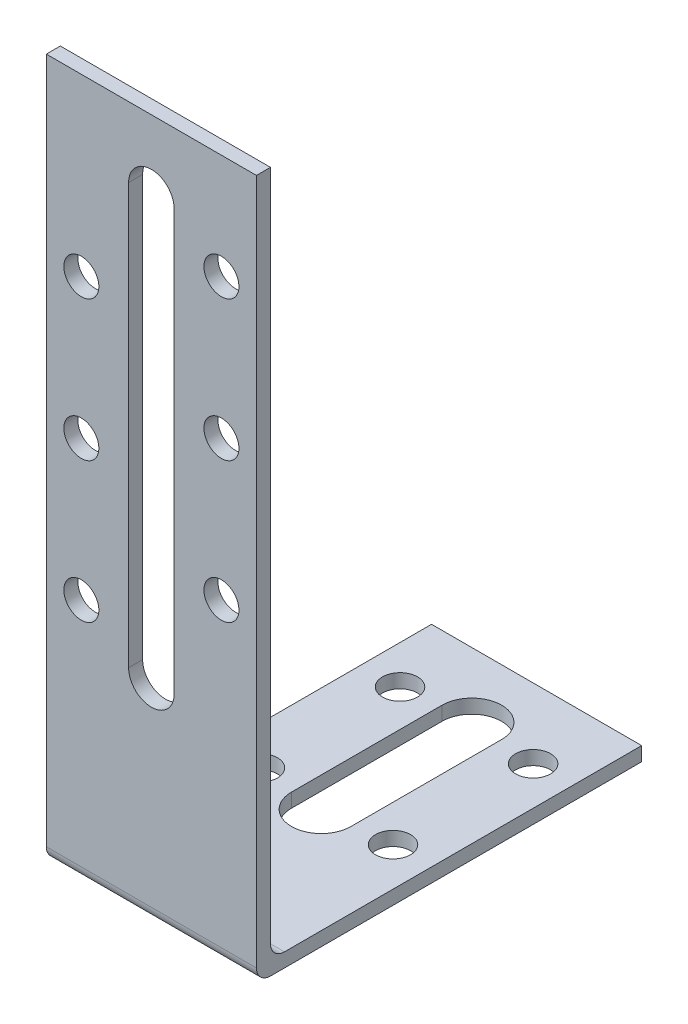
ISO-10303-21;
HEADER;
FILE_DESCRIPTION(('STEP AP214'),'2;1');
FILE_NAME('part.step','',(''),(''),'','','');
FILE_SCHEMA(('AUTOMOTIVE_DESIGN { 1 0 10303 214 1 1 1 1 }'));
ENDSEC;
DATA;
#1=APPLICATION_CONTEXT('core data for automotive mechanical design processes');
#2=APPLICATION_PROTOCOL_DEFINITION('international standard','automotive_design',2000,#1);
#3=PRODUCT_CONTEXT('',#1,'mechanical');
#4=PRODUCT('Part','Part','',(#3));
#5=PRODUCT_RELATED_PRODUCT_CATEGORY('part','',(#4));
#6=PRODUCT_DEFINITION_FORMATION('','',#4);
#7=PRODUCT_DEFINITION_CONTEXT('part definition',#1,'design');
#8=PRODUCT_DEFINITION('design','',#6,#7);
#9=PRODUCT_DEFINITION_SHAPE('','',#8);
#10=(LENGTH_UNIT() NAMED_UNIT(*) SI_UNIT(.MILLI.,.METRE.));
#11=(NAMED_UNIT(*) PLANE_ANGLE_UNIT() SI_UNIT($,.RADIAN.));
#12=(NAMED_UNIT(*) SI_UNIT($,.STERADIAN.) SOLID_ANGLE_UNIT());
#13=UNCERTAINTY_MEASURE_WITH_UNIT(LENGTH_MEASURE(1.E-05),#10,'distance_accuracy_value','');
#14=(GEOMETRIC_REPRESENTATION_CONTEXT(3) GLOBAL_UNCERTAINTY_ASSIGNED_CONTEXT((#13)) GLOBAL_UNIT_ASSIGNED_CONTEXT((#10,
#11,#12)) REPRESENTATION_CONTEXT('',''));
#15=CARTESIAN_POINT('',(0.,0.,0.));
#16=DIRECTION('',(0.,0.,1.));
#17=DIRECTION('',(1.,0.,0.));
#18=AXIS2_PLACEMENT_3D('',#15,#16,#17);
#19=CARTESIAN_POINT('',(15.,0.,-55.));
#20=DIRECTION('',(0.,1.,0.));
#21=DIRECTION('',(0.,0.,1.));
#22=AXIS2_PLACEMENT_3D('',#19,#20,#21);
#23=PLANE('',#22);
#24=CARTESIAN_POINT('',(9.5,0.,-45.));
#25=DIRECTION('',(0.,1.,0.));
#26=DIRECTION('',(0.,0.,1.));
#27=AXIS2_PLACEMENT_3D('',#24,#25,#26);
#28=CIRCLE('',#27,2.5);
#29=CARTESIAN_POINT('',(9.5,0.,-42.5));
#30=VERTEX_POINT('',#29);
#31=EDGE_CURVE('E209',#30,#30,#28,.F.);
#32=ORIENTED_EDGE('',*,*,#31,.F.);
#33=EDGE_LOOP('',(#32));
#34=FACE_BOUND('',#33,.T.);
#35=CARTESIAN_POINT('',(-9.49999999999999,0.,-25.));
#36=DIRECTION('',(0.,1.,0.));
#37=DIRECTION('',(0.,0.,1.));
#38=AXIS2_PLACEMENT_3D('',#35,#36,#37);
#39=CIRCLE('',#38,2.5);
#40=CARTESIAN_POINT('',(-9.49999999999999,0.,-22.5));
#41=VERTEX_POINT('',#40);
#42=EDGE_CURVE('E199',#41,#41,#39,.F.);
#43=ORIENTED_EDGE('',*,*,#42,.F.);
#44=EDGE_LOOP('',(#43));
#45=FACE_BOUND('',#44,.T.);
#46=CARTESIAN_POINT('',(0.,0.,-24.25));
#47=DIRECTION('',(0.,1.,0.));
#48=DIRECTION('',(0.,0.,1.));
#49=AXIS2_PLACEMENT_3D('',#46,#47,#48);
#50=CIRCLE('',#49,4.25);
#51=CARTESIAN_POINT('',(4.25,0.,-24.25));
#52=VERTEX_POINT('',#51);
#53=CARTESIAN_POINT('',(-4.25,0.,-24.25));
#54=VERTEX_POINT('',#53);
#55=EDGE_CURVE('E222',#52,#54,#50,.F.);
#56=ORIENTED_EDGE('',*,*,#55,.F.);
#57=DIRECTION('',(0.,0.,1.));
#58=VECTOR('',#57,1.);
#59=CARTESIAN_POINT('',(4.25,0.,0.));
#60=LINE('',#59,#58);
#61=CARTESIAN_POINT('',(4.25,0.,-45.75));
#62=VERTEX_POINT('',#61);
#63=EDGE_CURVE('E225',#62,#52,#60,.T.);
#64=ORIENTED_EDGE('',*,*,#63,.F.);
#65=CARTESIAN_POINT('',(0.,0.,-45.75));
#66=DIRECTION('',(0.,1.,0.));
#67=DIRECTION('',(0.,0.,1.));
#68=AXIS2_PLACEMENT_3D('',#65,#66,#67);
#69=CIRCLE('',#68,4.25);
#70=CARTESIAN_POINT('',(-4.25,0.,-45.75));
#71=VERTEX_POINT('',#70);
#72=EDGE_CURVE('E242',#71,#62,#69,.F.);
#73=ORIENTED_EDGE('',*,*,#72,.F.);
#74=DIRECTION('',(0.,0.,1.));
#75=VECTOR('',#74,1.);
#76=CARTESIAN_POINT('',(-4.25,0.,0.));
#77=LINE('',#76,#75);
#78=EDGE_CURVE('E203',#71,#54,#77,.T.);
#79=ORIENTED_EDGE('',*,*,#78,.T.);
#80=EDGE_LOOP('',(#56,#64,#73,#79));
#81=FACE_BOUND('',#80,.T.);
#82=DIRECTION('',(0.,0.,-1.));
#83=VECTOR('',#82,1.);
#84=CARTESIAN_POINT('',(15.,0.,-55.));
#85=LINE('',#84,#83);
#86=CARTESIAN_POINT('',(15.,0.,-2.));
#87=VERTEX_POINT('',#86);
#88=CARTESIAN_POINT('',(15.,0.,-55.));
#89=VERTEX_POINT('',#88);
#90=EDGE_CURVE('E252',#87,#89,#85,.T.);
#91=ORIENTED_EDGE('',*,*,#90,.F.);
#92=DIRECTION('',(-1.,0.,0.));
#93=VECTOR('',#92,1.);
#94=CARTESIAN_POINT('',(15.,0.,-2.));
#95=LINE('',#94,#93);
#96=CARTESIAN_POINT('',(-15.,0.,-2.));
#97=VERTEX_POINT('',#96);
#98=EDGE_CURVE('E291',#87,#97,#95,.T.);
#99=ORIENTED_EDGE('',*,*,#98,.T.);
#100=DIRECTION('',(0.,0.,-1.));
#101=VECTOR('',#100,1.);
#102=CARTESIAN_POINT('',(-15.,0.,-55.));
#103=LINE('',#102,#101);
#104=CARTESIAN_POINT('',(-15.,0.,-55.));
#105=VERTEX_POINT('',#104);
#106=EDGE_CURVE('E251',#97,#105,#103,.T.);
#107=ORIENTED_EDGE('',*,*,#106,.T.);
#108=DIRECTION('',(-1.,0.,0.));
#109=VECTOR('',#108,1.);
#110=CARTESIAN_POINT('',(15.,0.,-55.));
#111=LINE('',#110,#109);
#112=EDGE_CURVE('E288',#89,#105,#111,.T.);
#113=ORIENTED_EDGE('',*,*,#112,.F.);
#114=EDGE_LOOP('',(#91,#99,#107,#113));
#115=FACE_BOUND('',#114,.T.);
#116=CARTESIAN_POINT('',(-9.49999999999999,0.,-45.));
#117=DIRECTION('',(0.,1.,0.));
#118=DIRECTION('',(0.,0.,1.));
#119=AXIS2_PLACEMENT_3D('',#116,#117,#118);
#120=CIRCLE('',#119,2.5);
#121=CARTESIAN_POINT('',(-9.49999999999999,0.,-42.5));
#122=VERTEX_POINT('',#121);
#123=EDGE_CURVE('E206',#122,#122,#120,.T.);
#124=ORIENTED_EDGE('',*,*,#123,.T.);
#125=EDGE_LOOP('',(#124));
#126=FACE_BOUND('',#125,.T.);
#127=CARTESIAN_POINT('',(9.5,0.,-25.));
#128=DIRECTION('',(0.,1.,0.));
#129=DIRECTION('',(0.,0.,1.));
#130=AXIS2_PLACEMENT_3D('',#127,#128,#129);
#131=CIRCLE('',#130,2.5);
#132=CARTESIAN_POINT('',(9.5,0.,-22.5));
#133=VERTEX_POINT('',#132);
#134=EDGE_CURVE('E173',#133,#133,#131,.T.);
#135=ORIENTED_EDGE('',*,*,#134,.T.);
#136=EDGE_LOOP('',(#135));
#137=FACE_BOUND('',#136,.T.);
#138=ADVANCED_FACE('F47',(#34,#45,#81,#115,#126,#137),#23,.F.);
#139=CARTESIAN_POINT('',(15.,2.,-2.00000000000001));
#140=DIRECTION('',(0.,-1.,0.));
#141=DIRECTION('',(0.,0.,-1.));
#142=AXIS2_PLACEMENT_3D('',#139,#140,#141);
#143=PLANE('',#142);
#144=CARTESIAN_POINT('',(9.5,2.,-45.));
#145=DIRECTION('',(0.,1.,0.));
#146=DIRECTION('',(0.,0.,1.));
#147=AXIS2_PLACEMENT_3D('',#144,#145,#146);
#148=CIRCLE('',#147,2.5);
#149=CARTESIAN_POINT('',(9.5,2.,-42.5));
#150=VERTEX_POINT('',#149);
#151=EDGE_CURVE('E210',#150,#150,#148,.T.);
#152=ORIENTED_EDGE('',*,*,#151,.F.);
#153=EDGE_LOOP('',(#152));
#154=FACE_BOUND('',#153,.T.);
#155=CARTESIAN_POINT('',(-9.49999999999999,2.,-25.));
#156=DIRECTION('',(0.,1.,0.));
#157=DIRECTION('',(0.,0.,1.));
#158=AXIS2_PLACEMENT_3D('',#155,#156,#157);
#159=CIRCLE('',#158,2.5);
#160=CARTESIAN_POINT('',(-9.49999999999999,2.,-22.5));
#161=VERTEX_POINT('',#160);
#162=EDGE_CURVE('E196',#161,#161,#159,.T.);
#163=ORIENTED_EDGE('',*,*,#162,.F.);
#164=EDGE_LOOP('',(#163));
#165=FACE_BOUND('',#164,.T.);
#166=CARTESIAN_POINT('',(0.,2.,-45.75));
#167=DIRECTION('',(0.,1.,0.));
#168=DIRECTION('',(0.,0.,1.));
#169=AXIS2_PLACEMENT_3D('',#166,#167,#168);
#170=CIRCLE('',#169,4.25);
#171=CARTESIAN_POINT('',(4.25,2.,-45.75));
#172=VERTEX_POINT('',#171);
#173=CARTESIAN_POINT('',(-4.25,2.,-45.75));
#174=VERTEX_POINT('',#173);
#175=EDGE_CURVE('E230',#172,#174,#170,.T.);
#176=ORIENTED_EDGE('',*,*,#175,.F.);
#177=DIRECTION('',(0.,0.,-1.));
#178=VECTOR('',#177,1.);
#179=CARTESIAN_POINT('',(4.25,2.,0.));
#180=LINE('',#179,#178);
#181=CARTESIAN_POINT('',(4.25,2.,-24.25));
#182=VERTEX_POINT('',#181);
#183=EDGE_CURVE('E228',#182,#172,#180,.T.);
#184=ORIENTED_EDGE('',*,*,#183,.F.);
#185=CARTESIAN_POINT('',(0.,2.,-24.25));
#186=DIRECTION('',(0.,1.,0.));
#187=DIRECTION('',(0.,0.,1.));
#188=AXIS2_PLACEMENT_3D('',#185,#186,#187);
#189=CIRCLE('',#188,4.25);
#190=CARTESIAN_POINT('',(-4.25,2.,-24.25));
#191=VERTEX_POINT('',#190);
#192=EDGE_CURVE('E236',#191,#182,#189,.T.);
#193=ORIENTED_EDGE('',*,*,#192,.F.);
#194=DIRECTION('',(0.,0.,-1.));
#195=VECTOR('',#194,1.);
#196=CARTESIAN_POINT('',(-4.25,2.,0.));
#197=LINE('',#196,#195);
#198=EDGE_CURVE('E233',#191,#174,#197,.T.);
#199=ORIENTED_EDGE('',*,*,#198,.T.);
#200=EDGE_LOOP('',(#176,#184,#193,#199));
#201=FACE_BOUND('',#200,.T.);
#202=DIRECTION('',(0.,0.,1.));
#203=VECTOR('',#202,1.);
#204=CARTESIAN_POINT('',(-15.,2.,-2.00000000000001));
#205=LINE('',#204,#203);
#206=CARTESIAN_POINT('',(-15.,2.,-55.));
#207=VERTEX_POINT('',#206);
#208=CARTESIAN_POINT('',(-15.,2.,-4.00000000000001));
#209=VERTEX_POINT('',#208);
#210=EDGE_CURVE('E271',#207,#209,#205,.T.);
#211=ORIENTED_EDGE('',*,*,#210,.T.);
#212=DIRECTION('',(-1.,0.,0.));
#213=VECTOR('',#212,1.);
#214=CARTESIAN_POINT('',(15.,2.,-4.00000000000001));
#215=LINE('',#214,#213);
#216=CARTESIAN_POINT('',(15.,2.,-4.00000000000001));
#217=VERTEX_POINT('',#216);
#218=EDGE_CURVE('E303',#209,#217,#215,.F.);
#219=ORIENTED_EDGE('',*,*,#218,.T.);
#220=DIRECTION('',(0.,0.,1.));
#221=VECTOR('',#220,1.);
#222=CARTESIAN_POINT('',(15.,2.,-2.00000000000001));
#223=LINE('',#222,#221);
#224=CARTESIAN_POINT('',(15.,2.,-55.));
#225=VERTEX_POINT('',#224);
#226=EDGE_CURVE('E257',#225,#217,#223,.T.);
#227=ORIENTED_EDGE('',*,*,#226,.F.);
#228=DIRECTION('',(-1.,0.,0.));
#229=VECTOR('',#228,1.);
#230=CARTESIAN_POINT('',(15.,2.,-55.));
#231=LINE('',#230,#229);
#232=EDGE_CURVE('E285',#225,#207,#231,.T.);
#233=ORIENTED_EDGE('',*,*,#232,.T.);
#234=EDGE_LOOP('',(#211,#219,#227,#233));
#235=FACE_BOUND('',#234,.T.);
#236=CARTESIAN_POINT('',(-9.49999999999999,2.,-45.));
#237=DIRECTION('',(0.,1.,0.));
#238=DIRECTION('',(0.,0.,1.));
#239=AXIS2_PLACEMENT_3D('',#236,#237,#238);
#240=CIRCLE('',#239,2.5);
#241=CARTESIAN_POINT('',(-9.49999999999999,2.,-42.5));
#242=VERTEX_POINT('',#241);
#243=EDGE_CURVE('E200',#242,#242,#240,.F.);
#244=ORIENTED_EDGE('',*,*,#243,.T.);
#245=EDGE_LOOP('',(#244));
#246=FACE_BOUND('',#245,.T.);
#247=CARTESIAN_POINT('',(9.5,2.,-25.));
#248=DIRECTION('',(0.,1.,0.));
#249=DIRECTION('',(0.,0.,1.));
#250=AXIS2_PLACEMENT_3D('',#247,#248,#249);
#251=CIRCLE('',#250,2.5);
#252=CARTESIAN_POINT('',(9.5,2.,-22.5));
#253=VERTEX_POINT('',#252);
#254=EDGE_CURVE('E213',#253,#253,#251,.F.);
#255=ORIENTED_EDGE('',*,*,#254,.T.);
#256=EDGE_LOOP('',(#255));
#257=FACE_BOUND('',#256,.T.);
#258=ADVANCED_FACE('F315',(#154,#165,#201,#235,#246,#257),#143,.F.);
#259=CARTESIAN_POINT('',(15.,2.,-55.));
#260=DIRECTION('',(0.,0.,1.));
#261=DIRECTION('',(1.,0.,0.));
#262=AXIS2_PLACEMENT_3D('',#259,#260,#261);
#263=PLANE('',#262);
#264=DIRECTION('',(0.,1.,0.));
#265=VECTOR('',#264,1.);
#266=CARTESIAN_POINT('',(-15.,2.,-55.));
#267=LINE('',#266,#265);
#268=EDGE_CURVE('E269',#105,#207,#267,.T.);
#269=ORIENTED_EDGE('',*,*,#268,.T.);
#270=ORIENTED_EDGE('',*,*,#232,.F.);
#271=DIRECTION('',(0.,1.,0.));
#272=VECTOR('',#271,1.);
#273=CARTESIAN_POINT('',(15.,2.,-55.));
#274=LINE('',#273,#272);
#275=EDGE_CURVE('E254',#89,#225,#274,.T.);
#276=ORIENTED_EDGE('',*,*,#275,.F.);
#277=ORIENTED_EDGE('',*,*,#112,.T.);
#278=EDGE_LOOP('',(#269,#270,#276,#277));
#279=FACE_BOUND('',#278,.T.);
#280=ADVANCED_FACE('F343',(#279),#263,.F.);
#281=CARTESIAN_POINT('',(15.,100.,-2.));
#282=DIRECTION('',(0.,0.,1.));
#283=DIRECTION('',(0.,-1.,0.));
#284=AXIS2_PLACEMENT_3D('',#281,#282,#283);
#285=PLANE('',#284);
#286=CARTESIAN_POINT('',(-10.,75.,-2.));
#287=DIRECTION('',(0.,0.,-1.));
#288=DIRECTION('',(0.,1.,0.));
#289=AXIS2_PLACEMENT_3D('',#286,#287,#288);
#290=CIRCLE('',#289,2.5);
#291=CARTESIAN_POINT('',(-10.,77.5,-2.));
#292=VERTEX_POINT('',#291);
#293=EDGE_CURVE('E608',#292,#292,#290,.T.);
#294=ORIENTED_EDGE('',*,*,#293,.F.);
#295=EDGE_LOOP('',(#294));
#296=FACE_BOUND('',#295,.T.);
#297=CARTESIAN_POINT('',(10.,45.,-2.00000000000001));
#298=DIRECTION('',(0.,0.,-1.));
#299=DIRECTION('',(0.,1.,0.));
#300=AXIS2_PLACEMENT_3D('',#297,#298,#299);
#301=CIRCLE('',#300,2.5);
#302=CARTESIAN_POINT('',(10.,47.5,-2.00000000000001));
#303=VERTEX_POINT('',#302);
#304=EDGE_CURVE('E612',#303,#303,#301,.T.);
#305=ORIENTED_EDGE('',*,*,#304,.F.);
#306=EDGE_LOOP('',(#305));
#307=FACE_BOUND('',#306,.T.);
#308=CARTESIAN_POINT('',(10.,65.,-2.));
#309=DIRECTION('',(0.,0.,-1.));
#310=DIRECTION('',(0.,1.,0.));
#311=AXIS2_PLACEMENT_3D('',#308,#309,#310);
#312=CIRCLE('',#311,2.5);
#313=CARTESIAN_POINT('',(10.,67.5,-2.));
#314=VERTEX_POINT('',#313);
#315=EDGE_CURVE('E628',#314,#314,#312,.T.);
#316=ORIENTED_EDGE('',*,*,#315,.F.);
#317=EDGE_LOOP('',(#316));
#318=FACE_BOUND('',#317,.T.);
#319=CARTESIAN_POINT('',(10.,85.,-2.));
#320=DIRECTION('',(0.,0.,-1.));
#321=DIRECTION('',(0.,1.,0.));
#322=AXIS2_PLACEMENT_3D('',#319,#320,#321);
#323=CIRCLE('',#322,2.5);
#324=CARTESIAN_POINT('',(10.,87.5,-2.));
#325=VERTEX_POINT('',#324);
#326=EDGE_CURVE('E621',#325,#325,#323,.T.);
#327=ORIENTED_EDGE('',*,*,#326,.F.);
#328=EDGE_LOOP('',(#327));
#329=FACE_BOUND('',#328,.T.);
#330=CARTESIAN_POINT('',(-10.,55.,-2.00000000000001));
#331=DIRECTION('',(0.,0.,-1.));
#332=DIRECTION('',(0.,1.,0.));
#333=AXIS2_PLACEMENT_3D('',#330,#331,#332);
#334=CIRCLE('',#333,2.5);
#335=CARTESIAN_POINT('',(-10.,57.5,-2.00000000000001));
#336=VERTEX_POINT('',#335);
#337=EDGE_CURVE('E645',#336,#336,#334,.T.);
#338=ORIENTED_EDGE('',*,*,#337,.F.);
#339=EDGE_LOOP('',(#338));
#340=FACE_BOUND('',#339,.T.);
#341=CARTESIAN_POINT('',(-10.,35.,-2.00000000000001));
#342=DIRECTION('',(0.,0.,-1.));
#343=DIRECTION('',(0.,1.,0.));
#344=AXIS2_PLACEMENT_3D('',#341,#342,#343);
#345=CIRCLE('',#344,2.5);
#346=CARTESIAN_POINT('',(-10.,37.5,-2.00000000000001));
#347=VERTEX_POINT('',#346);
#348=EDGE_CURVE('E646',#347,#347,#345,.T.);
#349=ORIENTED_EDGE('',*,*,#348,.F.);
#350=EDGE_LOOP('',(#349));
#351=FACE_BOUND('',#350,.T.);
#352=DIRECTION('',(0.,-1.,0.));
#353=VECTOR('',#352,1.);
#354=CARTESIAN_POINT('',(3.25,90.,-2.));
#355=LINE('',#354,#353);
#356=CARTESIAN_POINT('',(3.25,90.,-2.));
#357=VERTEX_POINT('',#356);
#358=CARTESIAN_POINT('',(3.24999999999999,30.,-2.00000000000001));
#359=VERTEX_POINT('',#358);
#360=EDGE_CURVE('E181',#357,#359,#355,.T.);
#361=ORIENTED_EDGE('',*,*,#360,.F.);
#362=CARTESIAN_POINT('',(0.,90.,-2.));
#363=DIRECTION('',(0.,0.,-1.));
#364=DIRECTION('',(0.,1.,0.));
#365=AXIS2_PLACEMENT_3D('',#362,#363,#364);
#366=CIRCLE('',#365,3.25);
#367=CARTESIAN_POINT('',(-3.25,90.,-2.));
#368=VERTEX_POINT('',#367);
#369=EDGE_CURVE('E62',#368,#357,#366,.T.);
#370=ORIENTED_EDGE('',*,*,#369,.F.);
#371=DIRECTION('',(0.,1.,0.));
#372=VECTOR('',#371,1.);
#373=CARTESIAN_POINT('',(-3.25,90.,-2.));
#374=LINE('',#373,#372);
#375=CARTESIAN_POINT('',(-3.25000000000001,30.,-2.00000000000001));
#376=VERTEX_POINT('',#375);
#377=EDGE_CURVE('E167',#376,#368,#374,.T.);
#378=ORIENTED_EDGE('',*,*,#377,.F.);
#379=CARTESIAN_POINT('',(0.,30.,-2.00000000000001));
#380=DIRECTION('',(0.,0.,-1.));
#381=DIRECTION('',(0.,1.,0.));
#382=AXIS2_PLACEMENT_3D('',#379,#380,#381);
#383=CIRCLE('',#382,3.25);
#384=EDGE_CURVE('E187',#359,#376,#383,.T.);
#385=ORIENTED_EDGE('',*,*,#384,.F.);
#386=EDGE_LOOP('',(#361,#370,#378,#385));
#387=FACE_BOUND('',#386,.T.);
#388=DIRECTION('',(0.,1.,0.));
#389=VECTOR('',#388,1.);
#390=CARTESIAN_POINT('',(15.,100.,-2.));
#391=LINE('',#390,#389);
#392=CARTESIAN_POINT('',(15.,4.,-2.00000000000001));
#393=VERTEX_POINT('',#392);
#394=CARTESIAN_POINT('',(15.,100.,-2.));
#395=VERTEX_POINT('',#394);
#396=EDGE_CURVE('E260',#393,#395,#391,.T.);
#397=ORIENTED_EDGE('',*,*,#396,.F.);
#398=DIRECTION('',(-1.,0.,0.));
#399=VECTOR('',#398,1.);
#400=CARTESIAN_POINT('',(-15.,4.,-2.00000000000001));
#401=LINE('',#400,#399);
#402=CARTESIAN_POINT('',(-15.,4.,-2.00000000000001));
#403=VERTEX_POINT('',#402);
#404=EDGE_CURVE('E300',#393,#403,#401,.T.);
#405=ORIENTED_EDGE('',*,*,#404,.T.);
#406=DIRECTION('',(0.,1.,0.));
#407=VECTOR('',#406,1.);
#408=CARTESIAN_POINT('',(-15.,100.,-2.));
#409=LINE('',#408,#407);
#410=CARTESIAN_POINT('',(-15.,100.,-2.));
#411=VERTEX_POINT('',#410);
#412=EDGE_CURVE('E274',#403,#411,#409,.T.);
#413=ORIENTED_EDGE('',*,*,#412,.T.);
#414=DIRECTION('',(-1.,0.,0.));
#415=VECTOR('',#414,1.);
#416=CARTESIAN_POINT('',(15.,100.,-2.));
#417=LINE('',#416,#415);
#418=EDGE_CURVE('E282',#395,#411,#417,.T.);
#419=ORIENTED_EDGE('',*,*,#418,.F.);
#420=EDGE_LOOP('',(#397,#405,#413,#419));
#421=FACE_BOUND('',#420,.T.);
#422=ADVANCED_FACE('F325',(#296,#307,#318,#329,#340,#351,#387,#421),#285,.F.);
#423=CARTESIAN_POINT('',(15.,100.,0.));
#424=DIRECTION('',(0.,-1.,0.));
#425=DIRECTION('',(0.,0.,-1.));
#426=AXIS2_PLACEMENT_3D('',#423,#424,#425);
#427=PLANE('',#426);
#428=DIRECTION('',(0.,0.,1.));
#429=VECTOR('',#428,1.);
#430=CARTESIAN_POINT('',(-15.,100.,0.));
#431=LINE('',#430,#429);
#432=CARTESIAN_POINT('',(-15.,100.,0.));
#433=VERTEX_POINT('',#432);
#434=EDGE_CURVE('E276',#411,#433,#431,.T.);
#435=ORIENTED_EDGE('',*,*,#434,.T.);
#436=DIRECTION('',(-1.,0.,0.));
#437=VECTOR('',#436,1.);
#438=CARTESIAN_POINT('',(15.,100.,0.));
#439=LINE('',#438,#437);
#440=CARTESIAN_POINT('',(15.,100.,0.));
#441=VERTEX_POINT('',#440);
#442=EDGE_CURVE('E267',#441,#433,#439,.T.);
#443=ORIENTED_EDGE('',*,*,#442,.F.);
#444=DIRECTION('',(0.,0.,1.));
#445=VECTOR('',#444,1.);
#446=CARTESIAN_POINT('',(15.,100.,0.));
#447=LINE('',#446,#445);
#448=EDGE_CURVE('E262',#395,#441,#447,.T.);
#449=ORIENTED_EDGE('',*,*,#448,.F.);
#450=ORIENTED_EDGE('',*,*,#418,.T.);
#451=EDGE_LOOP('',(#435,#443,#449,#450));
#452=FACE_BOUND('',#451,.T.);
#453=ADVANCED_FACE('F329',(#452),#427,.F.);
#454=CARTESIAN_POINT('',(15.,0.,0.));
#455=DIRECTION('',(0.,0.,-1.));
#456=DIRECTION('',(-1.,0.,0.));
#457=AXIS2_PLACEMENT_3D('',#454,#455,#456);
#458=PLANE('',#457);
#459=CARTESIAN_POINT('',(-10.,75.,0.));
#460=DIRECTION('',(0.,0.,-1.));
#461=DIRECTION('',(-1.,0.,0.));
#462=AXIS2_PLACEMENT_3D('',#459,#460,#461);
#463=CIRCLE('',#462,2.5);
#464=CARTESIAN_POINT('',(-12.5,75.,0.));
#465=VERTEX_POINT('',#464);
#466=EDGE_CURVE('E611',#465,#465,#463,.F.);
#467=ORIENTED_EDGE('',*,*,#466,.F.);
#468=EDGE_LOOP('',(#467));
#469=FACE_BOUND('',#468,.T.);
#470=CARTESIAN_POINT('',(10.,45.,0.));
#471=DIRECTION('',(0.,0.,-1.));
#472=DIRECTION('',(-1.,0.,0.));
#473=AXIS2_PLACEMENT_3D('',#470,#471,#472);
#474=CIRCLE('',#473,2.5);
#475=CARTESIAN_POINT('',(7.5,45.,0.));
#476=VERTEX_POINT('',#475);
#477=EDGE_CURVE('E615',#476,#476,#474,.F.);
#478=ORIENTED_EDGE('',*,*,#477,.F.);
#479=EDGE_LOOP('',(#478));
#480=FACE_BOUND('',#479,.T.);
#481=CARTESIAN_POINT('',(10.,65.,0.));
#482=DIRECTION('',(0.,0.,-1.));
#483=DIRECTION('',(-1.,0.,0.));
#484=AXIS2_PLACEMENT_3D('',#481,#482,#483);
#485=CIRCLE('',#484,2.5);
#486=CARTESIAN_POINT('',(7.5,65.,0.));
#487=VERTEX_POINT('',#486);
#488=EDGE_CURVE('E625',#487,#487,#485,.F.);
#489=ORIENTED_EDGE('',*,*,#488,.F.);
#490=EDGE_LOOP('',(#489));
#491=FACE_BOUND('',#490,.T.);
#492=CARTESIAN_POINT('',(10.,85.,0.));
#493=DIRECTION('',(0.,0.,-1.));
#494=DIRECTION('',(-1.,0.,0.));
#495=AXIS2_PLACEMENT_3D('',#492,#493,#494);
#496=CIRCLE('',#495,2.5);
#497=CARTESIAN_POINT('',(7.5,85.,0.));
#498=VERTEX_POINT('',#497);
#499=EDGE_CURVE('E624',#498,#498,#496,.F.);
#500=ORIENTED_EDGE('',*,*,#499,.F.);
#501=EDGE_LOOP('',(#500));
#502=FACE_BOUND('',#501,.T.);
#503=CARTESIAN_POINT('',(-10.,55.,0.));
#504=DIRECTION('',(0.,0.,-1.));
#505=DIRECTION('',(-1.,0.,0.));
#506=AXIS2_PLACEMENT_3D('',#503,#504,#505);
#507=CIRCLE('',#506,2.5);
#508=CARTESIAN_POINT('',(-12.5,55.,0.));
#509=VERTEX_POINT('',#508);
#510=EDGE_CURVE('E617',#509,#509,#507,.F.);
#511=ORIENTED_EDGE('',*,*,#510,.F.);
#512=EDGE_LOOP('',(#511));
#513=FACE_BOUND('',#512,.T.);
#514=CARTESIAN_POINT('',(-10.,35.,0.));
#515=DIRECTION('',(0.,0.,-1.));
#516=DIRECTION('',(-1.,0.,0.));
#517=AXIS2_PLACEMENT_3D('',#514,#515,#516);
#518=CIRCLE('',#517,2.5);
#519=CARTESIAN_POINT('',(-12.5,35.,0.));
#520=VERTEX_POINT('',#519);
#521=EDGE_CURVE('E643',#520,#520,#518,.F.);
#522=ORIENTED_EDGE('',*,*,#521,.F.);
#523=EDGE_LOOP('',(#522));
#524=FACE_BOUND('',#523,.T.);
#525=DIRECTION('',(0.,-1.,0.));
#526=VECTOR('',#525,1.);
#527=CARTESIAN_POINT('',(-3.25,90.,0.));
#528=LINE('',#527,#526);
#529=CARTESIAN_POINT('',(-3.25,90.,0.));
#530=VERTEX_POINT('',#529);
#531=CARTESIAN_POINT('',(-3.25000000000001,30.,0.));
#532=VERTEX_POINT('',#531);
#533=EDGE_CURVE('E179',#530,#532,#528,.T.);
#534=ORIENTED_EDGE('',*,*,#533,.F.);
#535=CARTESIAN_POINT('',(0.,90.,0.));
#536=DIRECTION('',(0.,0.,-1.));
#537=DIRECTION('',(-1.,0.,0.));
#538=AXIS2_PLACEMENT_3D('',#535,#536,#537);
#539=CIRCLE('',#538,3.25);
#540=CARTESIAN_POINT('',(3.25,90.,0.));
#541=VERTEX_POINT('',#540);
#542=EDGE_CURVE('E161',#541,#530,#539,.F.);
#543=ORIENTED_EDGE('',*,*,#542,.F.);
#544=DIRECTION('',(0.,1.,0.));
#545=VECTOR('',#544,1.);
#546=CARTESIAN_POINT('',(3.25,90.,0.));
#547=LINE('',#546,#545);
#548=CARTESIAN_POINT('',(3.24999999999999,30.,0.));
#549=VERTEX_POINT('',#548);
#550=EDGE_CURVE('E170',#549,#541,#547,.T.);
#551=ORIENTED_EDGE('',*,*,#550,.F.);
#552=CARTESIAN_POINT('',(0.,30.,0.));
#553=DIRECTION('',(0.,0.,-1.));
#554=DIRECTION('',(-1.,0.,0.));
#555=AXIS2_PLACEMENT_3D('',#552,#553,#554);
#556=CIRCLE('',#555,3.25);
#557=EDGE_CURVE('E70',#532,#549,#556,.F.);
#558=ORIENTED_EDGE('',*,*,#557,.F.);
#559=EDGE_LOOP('',(#534,#543,#551,#558));
#560=FACE_BOUND('',#559,.T.);
#561=DIRECTION('',(0.,-1.,0.));
#562=VECTOR('',#561,1.);
#563=CARTESIAN_POINT('',(-15.,0.,0.));
#564=LINE('',#563,#562);
#565=CARTESIAN_POINT('',(-15.,2.,0.));
#566=VERTEX_POINT('',#565);
#567=EDGE_CURVE('E255',#433,#566,#564,.T.);
#568=ORIENTED_EDGE('',*,*,#567,.T.);
#569=DIRECTION('',(-1.,0.,0.));
#570=VECTOR('',#569,1.);
#571=CARTESIAN_POINT('',(15.,2.,0.));
#572=LINE('',#571,#570);
#573=CARTESIAN_POINT('',(15.,2.,0.));
#574=VERTEX_POINT('',#573);
#575=EDGE_CURVE('E296',#566,#574,#572,.F.);
#576=ORIENTED_EDGE('',*,*,#575,.T.);
#577=DIRECTION('',(0.,-1.,0.));
#578=VECTOR('',#577,1.);
#579=CARTESIAN_POINT('',(15.,0.,0.));
#580=LINE('',#579,#578);
#581=EDGE_CURVE('E264',#441,#574,#580,.T.);
#582=ORIENTED_EDGE('',*,*,#581,.F.);
#583=ORIENTED_EDGE('',*,*,#442,.T.);
#584=EDGE_LOOP('',(#568,#576,#582,#583));
#585=FACE_BOUND('',#584,.T.);
#586=ADVANCED_FACE('F176',(#469,#480,#491,#502,#513,#524,#560,#585),#458,.F.);
#587=CARTESIAN_POINT('',(15.,0.,0.));
#588=DIRECTION('',(-1.,0.,0.));
#589=DIRECTION('',(0.,0.,1.));
#590=AXIS2_PLACEMENT_3D('',#587,#588,#589);
#591=PLANE('',#590);
#592=ORIENTED_EDGE('',*,*,#581,.T.);
#593=CARTESIAN_POINT('',(15.,2.,-2.));
#594=DIRECTION('',(-1.,0.,0.));
#595=DIRECTION('',(0.,0.,1.));
#596=AXIS2_PLACEMENT_3D('',#593,#594,#595);
#597=CIRCLE('',#596,2.);
#598=EDGE_CURVE('E298',#574,#87,#597,.F.);
#599=ORIENTED_EDGE('',*,*,#598,.T.);
#600=ORIENTED_EDGE('',*,*,#90,.T.);
#601=ORIENTED_EDGE('',*,*,#275,.T.);
#602=ORIENTED_EDGE('',*,*,#226,.T.);
#603=CARTESIAN_POINT('',(15.,4.,-4.00000000000001));
#604=DIRECTION('',(-1.,0.,0.));
#605=DIRECTION('',(0.,0.,1.));
#606=AXIS2_PLACEMENT_3D('',#603,#604,#605);
#607=CIRCLE('',#606,2.);
#608=EDGE_CURVE('E13',#217,#393,#607,.T.);
#609=ORIENTED_EDGE('',*,*,#608,.T.);
#610=ORIENTED_EDGE('',*,*,#396,.T.);
#611=ORIENTED_EDGE('',*,*,#448,.T.);
#612=EDGE_LOOP('',(#592,#599,#600,#601,#602,#609,#610,#611));
#613=FACE_BOUND('',#612,.T.);
#614=ADVANCED_FACE('F322',(#613),#591,.F.);
#615=CARTESIAN_POINT('',(-15.,0.,0.));
#616=DIRECTION('',(-1.,0.,0.));
#617=DIRECTION('',(0.,0.,1.));
#618=AXIS2_PLACEMENT_3D('',#615,#616,#617);
#619=PLANE('',#618);
#620=ORIENTED_EDGE('',*,*,#106,.F.);
#621=CARTESIAN_POINT('',(-15.,2.,-2.));
#622=DIRECTION('',(-1.,0.,0.));
#623=DIRECTION('',(0.,0.,1.));
#624=AXIS2_PLACEMENT_3D('',#621,#622,#623);
#625=CIRCLE('',#624,2.);
#626=EDGE_CURVE('E294',#97,#566,#625,.T.);
#627=ORIENTED_EDGE('',*,*,#626,.T.);
#628=ORIENTED_EDGE('',*,*,#567,.F.);
#629=ORIENTED_EDGE('',*,*,#434,.F.);
#630=ORIENTED_EDGE('',*,*,#412,.F.);
#631=CARTESIAN_POINT('',(-15.,4.,-4.00000000000001));
#632=DIRECTION('',(-1.,0.,0.));
#633=DIRECTION('',(0.,0.,1.));
#634=AXIS2_PLACEMENT_3D('',#631,#632,#633);
#635=CIRCLE('',#634,2.);
#636=EDGE_CURVE('E55',#403,#209,#635,.F.);
#637=ORIENTED_EDGE('',*,*,#636,.T.);
#638=ORIENTED_EDGE('',*,*,#210,.F.);
#639=ORIENTED_EDGE('',*,*,#268,.F.);
#640=EDGE_LOOP('',(#620,#627,#628,#629,#630,#637,#638,#639));
#641=FACE_BOUND('',#640,.T.);
#642=ADVANCED_FACE('F308',(#641),#619,.T.);
#643=CARTESIAN_POINT('',(15.,2.,-2.));
#644=DIRECTION('',(-1.,0.,0.));
#645=DIRECTION('',(0.,0.,1.));
#646=AXIS2_PLACEMENT_3D('',#643,#644,#645);
#647=CYLINDRICAL_SURFACE('',#646,2.);
#648=ORIENTED_EDGE('',*,*,#598,.F.);
#649=ORIENTED_EDGE('',*,*,#575,.F.);
#650=ORIENTED_EDGE('',*,*,#626,.F.);
#651=ORIENTED_EDGE('',*,*,#98,.F.);
#652=EDGE_LOOP('',(#648,#649,#650,#651));
#653=FACE_BOUND('',#652,.T.);
#654=ADVANCED_FACE('F336',(#653),#647,.T.);
#655=CARTESIAN_POINT('',(15.,4.,-4.00000000000001));
#656=DIRECTION('',(1.,0.,0.));
#657=DIRECTION('',(0.,0.,-1.));
#658=AXIS2_PLACEMENT_3D('',#655,#656,#657);
#659=CYLINDRICAL_SURFACE('',#658,2.);
#660=ORIENTED_EDGE('',*,*,#608,.F.);
#661=ORIENTED_EDGE('',*,*,#218,.F.);
#662=ORIENTED_EDGE('',*,*,#636,.F.);
#663=ORIENTED_EDGE('',*,*,#404,.F.);
#664=EDGE_LOOP('',(#660,#661,#662,#663));
#665=FACE_BOUND('',#664,.T.);
#666=ADVANCED_FACE('F49',(#665),#659,.F.);
#667=CARTESIAN_POINT('',(4.25,-0.00100000000000317,0.));
#668=DIRECTION('',(1.,0.,0.));
#669=DIRECTION('',(0.,0.,-1.));
#670=AXIS2_PLACEMENT_3D('',#667,#668,#669);
#671=PLANE('',#670);
#672=ORIENTED_EDGE('',*,*,#63,.T.);
#673=DIRECTION('',(0.,1.,0.));
#674=VECTOR('',#673,1.);
#675=CARTESIAN_POINT('',(4.25,-0.00100000000000187,-24.25));
#676=LINE('',#675,#674);
#677=EDGE_CURVE('E240',#52,#182,#676,.T.);
#678=ORIENTED_EDGE('',*,*,#677,.T.);
#679=ORIENTED_EDGE('',*,*,#183,.T.);
#680=DIRECTION('',(0.,1.,0.));
#681=VECTOR('',#680,1.);
#682=CARTESIAN_POINT('',(4.25,-0.00100000000000057,-45.75));
#683=LINE('',#682,#681);
#684=EDGE_CURVE('E239',#62,#172,#683,.T.);
#685=ORIENTED_EDGE('',*,*,#684,.F.);
#686=EDGE_LOOP('',(#672,#678,#679,#685));
#687=FACE_BOUND('',#686,.T.);
#688=ADVANCED_FACE('F366',(#687),#671,.F.);
#689=CARTESIAN_POINT('',(0.,-0.00100000000000187,-24.25));
#690=DIRECTION('',(0.,1.,0.));
#691=DIRECTION('',(0.,0.,1.));
#692=AXIS2_PLACEMENT_3D('',#689,#690,#691);
#693=CYLINDRICAL_SURFACE('',#692,4.25);
#694=ORIENTED_EDGE('',*,*,#55,.T.);
#695=DIRECTION('',(0.,1.,0.));
#696=VECTOR('',#695,1.);
#697=CARTESIAN_POINT('',(-4.25,-0.00100000000000187,-24.25));
#698=LINE('',#697,#696);
#699=EDGE_CURVE('E243',#54,#191,#698,.T.);
#700=ORIENTED_EDGE('',*,*,#699,.T.);
#701=ORIENTED_EDGE('',*,*,#192,.T.);
#702=ORIENTED_EDGE('',*,*,#677,.F.);
#703=EDGE_LOOP('',(#694,#700,#701,#702));
#704=FACE_BOUND('',#703,.T.);
#705=ADVANCED_FACE('F424',(#704),#693,.F.);
#706=CARTESIAN_POINT('',(-4.25,-0.00100000000000317,0.));
#707=DIRECTION('',(1.,0.,0.));
#708=DIRECTION('',(0.,0.,-1.));
#709=AXIS2_PLACEMENT_3D('',#706,#707,#708);
#710=PLANE('',#709);
#711=DIRECTION('',(0.,1.,0.));
#712=VECTOR('',#711,1.);
#713=CARTESIAN_POINT('',(-4.25,-0.00100000000000057,-45.75));
#714=LINE('',#713,#712);
#715=EDGE_CURVE('E245',#71,#174,#714,.T.);
#716=ORIENTED_EDGE('',*,*,#715,.T.);
#717=ORIENTED_EDGE('',*,*,#198,.F.);
#718=ORIENTED_EDGE('',*,*,#699,.F.);
#719=ORIENTED_EDGE('',*,*,#78,.F.);
#720=EDGE_LOOP('',(#716,#717,#718,#719));
#721=FACE_BOUND('',#720,.T.);
#722=ADVANCED_FACE('F433',(#721),#710,.T.);
#723=CARTESIAN_POINT('',(0.,-0.00100000000000057,-45.75));
#724=DIRECTION('',(0.,1.,0.));
#725=DIRECTION('',(0.,0.,1.));
#726=AXIS2_PLACEMENT_3D('',#723,#724,#725);
#727=CYLINDRICAL_SURFACE('',#726,4.25);
#728=ORIENTED_EDGE('',*,*,#72,.T.);
#729=ORIENTED_EDGE('',*,*,#684,.T.);
#730=ORIENTED_EDGE('',*,*,#175,.T.);
#731=ORIENTED_EDGE('',*,*,#715,.F.);
#732=EDGE_LOOP('',(#728,#729,#730,#731));
#733=FACE_BOUND('',#732,.T.);
#734=ADVANCED_FACE('F443',(#733),#727,.F.);
#735=CARTESIAN_POINT('',(-9.49999999999999,-0.00100000000000187,-25.));
#736=DIRECTION('',(0.,1.,0.));
#737=DIRECTION('',(0.,0.,1.));
#738=AXIS2_PLACEMENT_3D('',#735,#736,#737);
#739=CYLINDRICAL_SURFACE('',#738,2.5);
#740=ORIENTED_EDGE('',*,*,#162,.T.);
#741=EDGE_LOOP('',(#740));
#742=FACE_BOUND('',#741,.T.);
#743=ORIENTED_EDGE('',*,*,#42,.T.);
#744=EDGE_LOOP('',(#743));
#745=FACE_BOUND('',#744,.T.);
#746=ADVANCED_FACE('F453',(#742,#745),#739,.F.);
#747=CARTESIAN_POINT('',(-9.49999999999999,-0.00100000000000057,-45.));
#748=DIRECTION('',(0.,1.,0.));
#749=DIRECTION('',(0.,0.,1.));
#750=AXIS2_PLACEMENT_3D('',#747,#748,#749);
#751=CYLINDRICAL_SURFACE('',#750,2.5);
#752=ORIENTED_EDGE('',*,*,#243,.F.);
#753=EDGE_LOOP('',(#752));
#754=FACE_BOUND('',#753,.T.);
#755=ORIENTED_EDGE('',*,*,#123,.F.);
#756=EDGE_LOOP('',(#755));
#757=FACE_BOUND('',#756,.T.);
#758=ADVANCED_FACE('F463',(#754,#757),#751,.F.);
#759=CARTESIAN_POINT('',(9.5,-0.00100000000000057,-45.));
#760=DIRECTION('',(0.,1.,0.));
#761=DIRECTION('',(0.,0.,1.));
#762=AXIS2_PLACEMENT_3D('',#759,#760,#761);
#763=CYLINDRICAL_SURFACE('',#762,2.5);
#764=ORIENTED_EDGE('',*,*,#151,.T.);
#765=EDGE_LOOP('',(#764));
#766=FACE_BOUND('',#765,.T.);
#767=ORIENTED_EDGE('',*,*,#31,.T.);
#768=EDGE_LOOP('',(#767));
#769=FACE_BOUND('',#768,.T.);
#770=ADVANCED_FACE('F473',(#766,#769),#763,.F.);
#771=CARTESIAN_POINT('',(9.5,-0.00100000000000187,-25.));
#772=DIRECTION('',(0.,1.,0.));
#773=DIRECTION('',(0.,0.,1.));
#774=AXIS2_PLACEMENT_3D('',#771,#772,#773);
#775=CYLINDRICAL_SURFACE('',#774,2.5);
#776=ORIENTED_EDGE('',*,*,#254,.F.);
#777=EDGE_LOOP('',(#776));
#778=FACE_BOUND('',#777,.T.);
#779=ORIENTED_EDGE('',*,*,#134,.F.);
#780=EDGE_LOOP('',(#779));
#781=FACE_BOUND('',#780,.T.);
#782=ADVANCED_FACE('F484',(#778,#781),#775,.F.);
#783=CARTESIAN_POINT('',(0.,90.,0.00100000000001097));
#784=DIRECTION('',(0.,0.,-1.));
#785=DIRECTION('',(0.,1.,0.));
#786=AXIS2_PLACEMENT_3D('',#783,#784,#785);
#787=CYLINDRICAL_SURFACE('',#786,3.25);
#788=ORIENTED_EDGE('',*,*,#542,.T.);
#789=DIRECTION('',(0.,0.,-1.));
#790=VECTOR('',#789,1.);
#791=CARTESIAN_POINT('',(-3.25,90.,0.00100000000001097));
#792=LINE('',#791,#790);
#793=EDGE_CURVE('E174',#530,#368,#792,.T.);
#794=ORIENTED_EDGE('',*,*,#793,.T.);
#795=ORIENTED_EDGE('',*,*,#369,.T.);
#796=DIRECTION('',(0.,0.,-1.));
#797=VECTOR('',#796,1.);
#798=CARTESIAN_POINT('',(3.25,90.,0.00100000000001097));
#799=LINE('',#798,#797);
#800=EDGE_CURVE('E157',#541,#357,#799,.T.);
#801=ORIENTED_EDGE('',*,*,#800,.F.);
#802=EDGE_LOOP('',(#788,#794,#795,#801));
#803=FACE_BOUND('',#802,.T.);
#804=ADVANCED_FACE('F159',(#803),#787,.F.);
#805=CARTESIAN_POINT('',(-3.25,90.,0.00100000000001097));
#806=DIRECTION('',(-1.,0.,0.));
#807=DIRECTION('',(0.,-1.,0.));
#808=AXIS2_PLACEMENT_3D('',#805,#806,#807);
#809=PLANE('',#808);
#810=ORIENTED_EDGE('',*,*,#533,.T.);
#811=DIRECTION('',(0.,0.,-1.));
#812=VECTOR('',#811,1.);
#813=CARTESIAN_POINT('',(-3.25000000000001,30.,0.0010000000000036));
#814=LINE('',#813,#812);
#815=EDGE_CURVE('E193',#532,#376,#814,.T.);
#816=ORIENTED_EDGE('',*,*,#815,.T.);
#817=ORIENTED_EDGE('',*,*,#377,.T.);
#818=ORIENTED_EDGE('',*,*,#793,.F.);
#819=EDGE_LOOP('',(#810,#816,#817,#818));
#820=FACE_BOUND('',#819,.T.);
#821=ADVANCED_FACE('F515',(#820),#809,.F.);
#822=CARTESIAN_POINT('',(0.,30.,0.0010000000000036));
#823=DIRECTION('',(0.,0.,-1.));
#824=DIRECTION('',(0.,1.,0.));
#825=AXIS2_PLACEMENT_3D('',#822,#823,#824);
#826=CYLINDRICAL_SURFACE('',#825,3.25);
#827=ORIENTED_EDGE('',*,*,#557,.T.);
#828=DIRECTION('',(0.,0.,-1.));
#829=VECTOR('',#828,1.);
#830=CARTESIAN_POINT('',(3.24999999999999,30.,0.0010000000000036));
#831=LINE('',#830,#829);
#832=EDGE_CURVE('E166',#549,#359,#831,.T.);
#833=ORIENTED_EDGE('',*,*,#832,.T.);
#834=ORIENTED_EDGE('',*,*,#384,.T.);
#835=ORIENTED_EDGE('',*,*,#815,.F.);
#836=EDGE_LOOP('',(#827,#833,#834,#835));
#837=FACE_BOUND('',#836,.T.);
#838=ADVANCED_FACE('F521',(#837),#826,.F.);
#839=CARTESIAN_POINT('',(3.25,90.,0.00100000000001097));
#840=DIRECTION('',(1.,0.,0.));
#841=DIRECTION('',(0.,1.,0.));
#842=AXIS2_PLACEMENT_3D('',#839,#840,#841);
#843=PLANE('',#842);
#844=ORIENTED_EDGE('',*,*,#550,.T.);
#845=ORIENTED_EDGE('',*,*,#800,.T.);
#846=ORIENTED_EDGE('',*,*,#360,.T.);
#847=ORIENTED_EDGE('',*,*,#832,.F.);
#848=EDGE_LOOP('',(#844,#845,#846,#847));
#849=FACE_BOUND('',#848,.T.);
#850=ADVANCED_FACE('F171',(#849),#843,.F.);
#851=CARTESIAN_POINT('',(-10.,35.,0.00100000000000447));
#852=DIRECTION('',(0.,0.,-1.));
#853=DIRECTION('',(0.,1.,0.));
#854=AXIS2_PLACEMENT_3D('',#851,#852,#853);
#855=CYLINDRICAL_SURFACE('',#854,2.5);
#856=ORIENTED_EDGE('',*,*,#348,.T.);
#857=EDGE_LOOP('',(#856));
#858=FACE_BOUND('',#857,.T.);
#859=ORIENTED_EDGE('',*,*,#521,.T.);
#860=EDGE_LOOP('',(#859));
#861=FACE_BOUND('',#860,.T.);
#862=ADVANCED_FACE('F535',(#858,#861),#855,.F.);
#863=CARTESIAN_POINT('',(-10.,55.,0.00100000000000664));
#864=DIRECTION('',(0.,0.,-1.));
#865=DIRECTION('',(0.,1.,0.));
#866=AXIS2_PLACEMENT_3D('',#863,#864,#865);
#867=CYLINDRICAL_SURFACE('',#866,2.5);
#868=ORIENTED_EDGE('',*,*,#337,.T.);
#869=EDGE_LOOP('',(#868));
#870=FACE_BOUND('',#869,.T.);
#871=ORIENTED_EDGE('',*,*,#510,.T.);
#872=EDGE_LOOP('',(#871));
#873=FACE_BOUND('',#872,.T.);
#874=ADVANCED_FACE('F542',(#870,#873),#867,.F.);
#875=CARTESIAN_POINT('',(10.,85.,0.00100000000001011));
#876=DIRECTION('',(0.,0.,-1.));
#877=DIRECTION('',(0.,1.,0.));
#878=AXIS2_PLACEMENT_3D('',#875,#876,#877);
#879=CYLINDRICAL_SURFACE('',#878,2.5);
#880=ORIENTED_EDGE('',*,*,#326,.T.);
#881=EDGE_LOOP('',(#880));
#882=FACE_BOUND('',#881,.T.);
#883=ORIENTED_EDGE('',*,*,#499,.T.);
#884=EDGE_LOOP('',(#883));
#885=FACE_BOUND('',#884,.T.);
#886=ADVANCED_FACE('F550',(#882,#885),#879,.F.);
#887=CARTESIAN_POINT('',(10.,65.,0.00100000000000794));
#888=DIRECTION('',(0.,0.,-1.));
#889=DIRECTION('',(0.,1.,0.));
#890=AXIS2_PLACEMENT_3D('',#887,#888,#889);
#891=CYLINDRICAL_SURFACE('',#890,2.5);
#892=ORIENTED_EDGE('',*,*,#315,.T.);
#893=EDGE_LOOP('',(#892));
#894=FACE_BOUND('',#893,.T.);
#895=ORIENTED_EDGE('',*,*,#488,.T.);
#896=EDGE_LOOP('',(#895));
#897=FACE_BOUND('',#896,.T.);
#898=ADVANCED_FACE('F558',(#894,#897),#891,.F.);
#899=CARTESIAN_POINT('',(10.,45.,0.00100000000000534));
#900=DIRECTION('',(0.,0.,-1.));
#901=DIRECTION('',(0.,1.,0.));
#902=AXIS2_PLACEMENT_3D('',#899,#900,#901);
#903=CYLINDRICAL_SURFACE('',#902,2.5);
#904=ORIENTED_EDGE('',*,*,#304,.T.);
#905=EDGE_LOOP('',(#904));
#906=FACE_BOUND('',#905,.T.);
#907=ORIENTED_EDGE('',*,*,#477,.T.);
#908=EDGE_LOOP('',(#907));
#909=FACE_BOUND('',#908,.T.);
#910=ADVANCED_FACE('F566',(#906,#909),#903,.F.);
#911=CARTESIAN_POINT('',(-10.,75.,0.00100000000000924));
#912=DIRECTION('',(0.,0.,-1.));
#913=DIRECTION('',(0.,1.,0.));
#914=AXIS2_PLACEMENT_3D('',#911,#912,#913);
#915=CYLINDRICAL_SURFACE('',#914,2.5);
#916=ORIENTED_EDGE('',*,*,#293,.T.);
#917=EDGE_LOOP('',(#916));
#918=FACE_BOUND('',#917,.T.);
#919=ORIENTED_EDGE('',*,*,#466,.T.);
#920=EDGE_LOOP('',(#919));
#921=FACE_BOUND('',#920,.T.);
#922=ADVANCED_FACE('F574',(#918,#921),#915,.F.);
#923=CLOSED_SHELL('',(#138,#258,#280,#422,#453,#586,#614,#642,#654,#666,#688,#705,#722,#734,
#746,#758,#770,#782,#804,#821,#838,#850,#862,#874,#886,#898,#910,#922));
#924=MANIFOLD_SOLID_BREP('B2',#923);
#925=ADVANCED_BREP_SHAPE_REPRESENTATION('',(#18,#924),#14);
#926=SHAPE_DEFINITION_REPRESENTATION(#9,#925);
ENDSEC;
END-ISO-10303-21;
